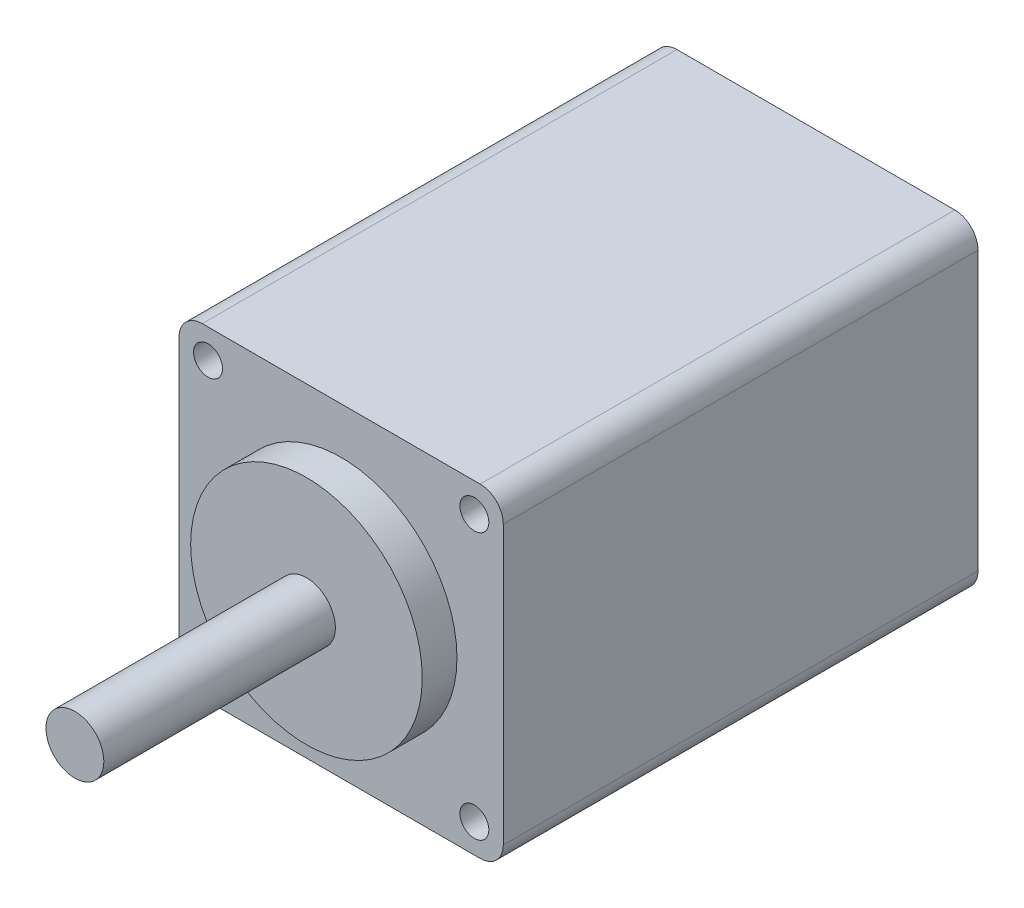
ISO-10303-21;
HEADER;
FILE_DESCRIPTION(('STEP AP214'),'2;1');
FILE_NAME('part.step','',(''),(''),'','','');
FILE_SCHEMA(('AUTOMOTIVE_DESIGN { 1 0 10303 214 1 1 1 1 }'));
ENDSEC;
DATA;
#1=APPLICATION_CONTEXT('core data for automotive mechanical design processes');
#2=APPLICATION_PROTOCOL_DEFINITION('international standard','automotive_design',2000,#1);
#3=PRODUCT_CONTEXT('',#1,'mechanical');
#4=PRODUCT('Part','Part','',(#3));
#5=PRODUCT_RELATED_PRODUCT_CATEGORY('part','',(#4));
#6=PRODUCT_DEFINITION_FORMATION('','',#4);
#7=PRODUCT_DEFINITION_CONTEXT('part definition',#1,'design');
#8=PRODUCT_DEFINITION('design','',#6,#7);
#9=PRODUCT_DEFINITION_SHAPE('','',#8);
#10=(LENGTH_UNIT() NAMED_UNIT(*) SI_UNIT(.MILLI.,.METRE.));
#11=(NAMED_UNIT(*) PLANE_ANGLE_UNIT() SI_UNIT($,.RADIAN.));
#12=(NAMED_UNIT(*) SI_UNIT($,.STERADIAN.) SOLID_ANGLE_UNIT());
#13=UNCERTAINTY_MEASURE_WITH_UNIT(LENGTH_MEASURE(1.E-05),#10,'distance_accuracy_value','');
#14=(GEOMETRIC_REPRESENTATION_CONTEXT(3) GLOBAL_UNCERTAINTY_ASSIGNED_CONTEXT((#13)) GLOBAL_UNIT_ASSIGNED_CONTEXT((#10,
#11,#12)) REPRESENTATION_CONTEXT('',''));
#15=CARTESIAN_POINT('',(0.,0.,0.));
#16=DIRECTION('',(0.,0.,1.));
#17=DIRECTION('',(1.,0.,0.));
#18=AXIS2_PLACEMENT_3D('',#15,#16,#17);
#19=CARTESIAN_POINT('',(0.,0.,41.));
#20=DIRECTION('',(0.,0.,1.));
#21=DIRECTION('',(1.,0.,0.));
#22=AXIS2_PLACEMENT_3D('',#19,#20,#21);
#23=PLANE('',#22);
#24=CARTESIAN_POINT('',(0.,0.,41.));
#25=DIRECTION('',(0.,0.,1.));
#26=DIRECTION('',(1.,0.,0.));
#27=AXIS2_PLACEMENT_3D('',#24,#25,#26);
#28=CIRCLE('',#27,10.);
#29=CARTESIAN_POINT('',(10.,0.,41.));
#30=VERTEX_POINT('',#29);
#31=EDGE_CURVE('E202',#30,#30,#28,.T.);
#32=ORIENTED_EDGE('',*,*,#31,.F.);
#33=EDGE_LOOP('',(#32));
#34=FACE_BOUND('',#33,.T.);
#35=CARTESIAN_POINT('',(11.5,-11.5,41.));
#36=DIRECTION('',(0.,0.,1.));
#37=DIRECTION('',(1.,0.,0.));
#38=AXIS2_PLACEMENT_3D('',#35,#36,#37);
#39=CIRCLE('',#38,1.25);
#40=CARTESIAN_POINT('',(12.75,-11.5,41.));
#41=VERTEX_POINT('',#40);
#42=EDGE_CURVE('E187',#41,#41,#39,.T.);
#43=ORIENTED_EDGE('',*,*,#42,.F.);
#44=EDGE_LOOP('',(#43));
#45=FACE_BOUND('',#44,.T.);
#46=CARTESIAN_POINT('',(-11.5,11.5,41.));
#47=DIRECTION('',(0.,0.,1.));
#48=DIRECTION('',(1.,0.,0.));
#49=AXIS2_PLACEMENT_3D('',#46,#47,#48);
#50=CIRCLE('',#49,1.25);
#51=CARTESIAN_POINT('',(-10.25,11.5,41.));
#52=VERTEX_POINT('',#51);
#53=EDGE_CURVE('E170',#52,#52,#50,.T.);
#54=ORIENTED_EDGE('',*,*,#53,.F.);
#55=EDGE_LOOP('',(#54));
#56=FACE_BOUND('',#55,.T.);
#57=DIRECTION('',(0.,-1.,0.));
#58=VECTOR('',#57,1.);
#59=CARTESIAN_POINT('',(-14.,14.,41.));
#60=LINE('',#59,#58);
#61=CARTESIAN_POINT('',(-14.,12.,41.));
#62=VERTEX_POINT('',#61);
#63=CARTESIAN_POINT('',(-14.,-12.,41.));
#64=VERTEX_POINT('',#63);
#65=EDGE_CURVE('E177',#62,#64,#60,.T.);
#66=ORIENTED_EDGE('',*,*,#65,.T.);
#67=CARTESIAN_POINT('',(-12.,-12.,41.));
#68=DIRECTION('',(0.,0.,1.));
#69=DIRECTION('',(1.,0.,0.));
#70=AXIS2_PLACEMENT_3D('',#67,#68,#69);
#71=CIRCLE('',#70,2.);
#72=CARTESIAN_POINT('',(-12.,-14.,41.));
#73=VERTEX_POINT('',#72);
#74=EDGE_CURVE('E154',#64,#73,#71,.T.);
#75=ORIENTED_EDGE('',*,*,#74,.T.);
#76=DIRECTION('',(1.,0.,0.));
#77=VECTOR('',#76,1.);
#78=CARTESIAN_POINT('',(-14.,-14.,41.));
#79=LINE('',#78,#77);
#80=CARTESIAN_POINT('',(12.,-14.,41.));
#81=VERTEX_POINT('',#80);
#82=EDGE_CURVE('E124',#73,#81,#79,.T.);
#83=ORIENTED_EDGE('',*,*,#82,.T.);
#84=CARTESIAN_POINT('',(12.,-12.,41.));
#85=DIRECTION('',(0.,0.,1.));
#86=DIRECTION('',(1.,0.,0.));
#87=AXIS2_PLACEMENT_3D('',#84,#85,#86);
#88=CIRCLE('',#87,2.);
#89=CARTESIAN_POINT('',(14.,-12.,41.));
#90=VERTEX_POINT('',#89);
#91=EDGE_CURVE('E152',#81,#90,#88,.T.);
#92=ORIENTED_EDGE('',*,*,#91,.T.);
#93=DIRECTION('',(0.,1.,0.));
#94=VECTOR('',#93,1.);
#95=CARTESIAN_POINT('',(14.,14.,41.));
#96=LINE('',#95,#94);
#97=CARTESIAN_POINT('',(14.,12.,41.));
#98=VERTEX_POINT('',#97);
#99=EDGE_CURVE('E131',#90,#98,#96,.T.);
#100=ORIENTED_EDGE('',*,*,#99,.T.);
#101=CARTESIAN_POINT('',(12.,12.,41.));
#102=DIRECTION('',(0.,0.,1.));
#103=DIRECTION('',(1.,0.,0.));
#104=AXIS2_PLACEMENT_3D('',#101,#102,#103);
#105=CIRCLE('',#104,2.);
#106=CARTESIAN_POINT('',(12.,14.,41.));
#107=VERTEX_POINT('',#106);
#108=EDGE_CURVE('E59',#98,#107,#105,.T.);
#109=ORIENTED_EDGE('',*,*,#108,.T.);
#110=DIRECTION('',(-1.,0.,0.));
#111=VECTOR('',#110,1.);
#112=CARTESIAN_POINT('',(-14.,14.,41.));
#113=LINE('',#112,#111);
#114=CARTESIAN_POINT('',(-12.,14.,41.));
#115=VERTEX_POINT('',#114);
#116=EDGE_CURVE('E134',#107,#115,#113,.T.);
#117=ORIENTED_EDGE('',*,*,#116,.T.);
#118=CARTESIAN_POINT('',(-12.,12.,41.));
#119=DIRECTION('',(0.,0.,1.));
#120=DIRECTION('',(1.,0.,0.));
#121=AXIS2_PLACEMENT_3D('',#118,#119,#120);
#122=CIRCLE('',#121,2.);
#123=EDGE_CURVE('E149',#115,#62,#122,.T.);
#124=ORIENTED_EDGE('',*,*,#123,.T.);
#125=EDGE_LOOP('',(#66,#75,#83,#92,#100,#109,#117,#124));
#126=FACE_BOUND('',#125,.T.);
#127=CARTESIAN_POINT('',(11.5,11.5,41.));
#128=DIRECTION('',(0.,0.,1.));
#129=DIRECTION('',(-1.,0.,0.));
#130=AXIS2_PLACEMENT_3D('',#127,#128,#129);
#131=CIRCLE('',#130,1.25);
#132=CARTESIAN_POINT('',(10.25,11.5,41.));
#133=VERTEX_POINT('',#132);
#134=EDGE_CURVE('E182',#133,#133,#131,.T.);
#135=ORIENTED_EDGE('',*,*,#134,.F.);
#136=EDGE_LOOP('',(#135));
#137=FACE_BOUND('',#136,.T.);
#138=CARTESIAN_POINT('',(-11.5,-11.5,41.));
#139=DIRECTION('',(0.,0.,1.));
#140=DIRECTION('',(-1.,0.,0.));
#141=AXIS2_PLACEMENT_3D('',#138,#139,#140);
#142=CIRCLE('',#141,1.25);
#143=CARTESIAN_POINT('',(-12.75,-11.5,41.));
#144=VERTEX_POINT('',#143);
#145=EDGE_CURVE('E193',#144,#144,#142,.T.);
#146=ORIENTED_EDGE('',*,*,#145,.F.);
#147=EDGE_LOOP('',(#146));
#148=FACE_BOUND('',#147,.T.);
#149=ADVANCED_FACE('F38',(#34,#45,#56,#126,#137,#148),#23,.T.);
#150=CARTESIAN_POINT('',(0.,0.,0.));
#151=DIRECTION('',(0.,0.,1.));
#152=DIRECTION('',(1.,0.,0.));
#153=AXIS2_PLACEMENT_3D('',#150,#151,#152);
#154=PLANE('',#153);
#155=DIRECTION('',(1.,0.,0.));
#156=VECTOR('',#155,1.);
#157=CARTESIAN_POINT('',(-14.,-14.,0.));
#158=LINE('',#157,#156);
#159=CARTESIAN_POINT('',(-12.,-14.,0.));
#160=VERTEX_POINT('',#159);
#161=CARTESIAN_POINT('',(12.,-14.,0.));
#162=VERTEX_POINT('',#161);
#163=EDGE_CURVE('E121',#160,#162,#158,.T.);
#164=ORIENTED_EDGE('',*,*,#163,.F.);
#165=CARTESIAN_POINT('',(-12.,-12.,0.));
#166=DIRECTION('',(0.,0.,1.));
#167=DIRECTION('',(1.,0.,0.));
#168=AXIS2_PLACEMENT_3D('',#165,#166,#167);
#169=CIRCLE('',#168,2.);
#170=CARTESIAN_POINT('',(-14.,-12.,0.));
#171=VERTEX_POINT('',#170);
#172=EDGE_CURVE('E104',#160,#171,#169,.F.);
#173=ORIENTED_EDGE('',*,*,#172,.T.);
#174=DIRECTION('',(0.,-1.,0.));
#175=VECTOR('',#174,1.);
#176=CARTESIAN_POINT('',(-14.,14.,0.));
#177=LINE('',#176,#175);
#178=CARTESIAN_POINT('',(-14.,12.,0.));
#179=VERTEX_POINT('',#178);
#180=EDGE_CURVE('E132',#179,#171,#177,.T.);
#181=ORIENTED_EDGE('',*,*,#180,.F.);
#182=CARTESIAN_POINT('',(-12.,12.,0.));
#183=DIRECTION('',(0.,0.,1.));
#184=DIRECTION('',(1.,0.,0.));
#185=AXIS2_PLACEMENT_3D('',#182,#183,#184);
#186=CIRCLE('',#185,2.);
#187=CARTESIAN_POINT('',(-12.,14.,0.));
#188=VERTEX_POINT('',#187);
#189=EDGE_CURVE('E125',#179,#188,#186,.F.);
#190=ORIENTED_EDGE('',*,*,#189,.T.);
#191=DIRECTION('',(-1.,0.,0.));
#192=VECTOR('',#191,1.);
#193=CARTESIAN_POINT('',(-14.,14.,0.));
#194=LINE('',#193,#192);
#195=CARTESIAN_POINT('',(12.,14.,0.));
#196=VERTEX_POINT('',#195);
#197=EDGE_CURVE('E136',#196,#188,#194,.T.);
#198=ORIENTED_EDGE('',*,*,#197,.F.);
#199=CARTESIAN_POINT('',(12.,12.,0.));
#200=DIRECTION('',(0.,0.,1.));
#201=DIRECTION('',(1.,0.,0.));
#202=AXIS2_PLACEMENT_3D('',#199,#200,#201);
#203=CIRCLE('',#202,2.);
#204=CARTESIAN_POINT('',(14.,12.,0.));
#205=VERTEX_POINT('',#204);
#206=EDGE_CURVE('E143',#196,#205,#203,.F.);
#207=ORIENTED_EDGE('',*,*,#206,.T.);
#208=DIRECTION('',(0.,1.,0.));
#209=VECTOR('',#208,1.);
#210=CARTESIAN_POINT('',(14.,14.,0.));
#211=LINE('',#210,#209);
#212=CARTESIAN_POINT('',(14.,-12.,0.));
#213=VERTEX_POINT('',#212);
#214=EDGE_CURVE('E165',#213,#205,#211,.T.);
#215=ORIENTED_EDGE('',*,*,#214,.F.);
#216=CARTESIAN_POINT('',(12.,-12.,0.));
#217=DIRECTION('',(0.,0.,1.));
#218=DIRECTION('',(1.,0.,0.));
#219=AXIS2_PLACEMENT_3D('',#216,#217,#218);
#220=CIRCLE('',#219,2.);
#221=EDGE_CURVE('E115',#213,#162,#220,.F.);
#222=ORIENTED_EDGE('',*,*,#221,.T.);
#223=EDGE_LOOP('',(#164,#173,#181,#190,#198,#207,#215,#222));
#224=FACE_BOUND('',#223,.T.);
#225=CARTESIAN_POINT('',(-11.5,11.5,0.));
#226=DIRECTION('',(0.,0.,1.));
#227=DIRECTION('',(1.,0.,0.));
#228=AXIS2_PLACEMENT_3D('',#225,#226,#227);
#229=CIRCLE('',#228,1.25);
#230=CARTESIAN_POINT('',(-10.25,11.5,0.));
#231=VERTEX_POINT('',#230);
#232=EDGE_CURVE('E173',#231,#231,#229,.T.);
#233=ORIENTED_EDGE('',*,*,#232,.T.);
#234=EDGE_LOOP('',(#233));
#235=FACE_BOUND('',#234,.T.);
#236=CARTESIAN_POINT('',(11.5,11.5,0.));
#237=DIRECTION('',(0.,0.,1.));
#238=DIRECTION('',(-1.,0.,0.));
#239=AXIS2_PLACEMENT_3D('',#236,#237,#238);
#240=CIRCLE('',#239,1.25);
#241=CARTESIAN_POINT('',(10.25,11.5,0.));
#242=VERTEX_POINT('',#241);
#243=EDGE_CURVE('E184',#242,#242,#240,.T.);
#244=ORIENTED_EDGE('',*,*,#243,.T.);
#245=EDGE_LOOP('',(#244));
#246=FACE_BOUND('',#245,.T.);
#247=CARTESIAN_POINT('',(11.5,-11.5,0.));
#248=DIRECTION('',(0.,0.,1.));
#249=DIRECTION('',(1.,0.,0.));
#250=AXIS2_PLACEMENT_3D('',#247,#248,#249);
#251=CIRCLE('',#250,1.25);
#252=CARTESIAN_POINT('',(12.75,-11.5,0.));
#253=VERTEX_POINT('',#252);
#254=EDGE_CURVE('E190',#253,#253,#251,.T.);
#255=ORIENTED_EDGE('',*,*,#254,.T.);
#256=EDGE_LOOP('',(#255));
#257=FACE_BOUND('',#256,.T.);
#258=CARTESIAN_POINT('',(-11.5,-11.5,0.));
#259=DIRECTION('',(0.,0.,1.));
#260=DIRECTION('',(-1.,0.,0.));
#261=AXIS2_PLACEMENT_3D('',#258,#259,#260);
#262=CIRCLE('',#261,1.25);
#263=CARTESIAN_POINT('',(-12.75,-11.5,0.));
#264=VERTEX_POINT('',#263);
#265=EDGE_CURVE('E196',#264,#264,#262,.T.);
#266=ORIENTED_EDGE('',*,*,#265,.T.);
#267=EDGE_LOOP('',(#266));
#268=FACE_BOUND('',#267,.T.);
#269=ADVANCED_FACE('F128',(#224,#235,#246,#257,#268),#154,.F.);
#270=CARTESIAN_POINT('',(14.,14.,41.));
#271=DIRECTION('',(-1.,0.,0.));
#272=DIRECTION('',(0.,0.,1.));
#273=AXIS2_PLACEMENT_3D('',#270,#271,#272);
#274=PLANE('',#273);
#275=ORIENTED_EDGE('',*,*,#99,.F.);
#276=DIRECTION('',(0.,0.,-1.));
#277=VECTOR('',#276,1.);
#278=CARTESIAN_POINT('',(14.,-12.,41.));
#279=LINE('',#278,#277);
#280=EDGE_CURVE('E158',#90,#213,#279,.T.);
#281=ORIENTED_EDGE('',*,*,#280,.T.);
#282=ORIENTED_EDGE('',*,*,#214,.T.);
#283=DIRECTION('',(0.,0.,-1.));
#284=VECTOR('',#283,1.);
#285=CARTESIAN_POINT('',(14.,12.,41.));
#286=LINE('',#285,#284);
#287=EDGE_CURVE('E156',#205,#98,#286,.F.);
#288=ORIENTED_EDGE('',*,*,#287,.T.);
#289=EDGE_LOOP('',(#275,#281,#282,#288));
#290=FACE_BOUND('',#289,.T.);
#291=ADVANCED_FACE('F164',(#290),#274,.F.);
#292=CARTESIAN_POINT('',(-14.,14.,41.));
#293=DIRECTION('',(0.,-1.,0.));
#294=DIRECTION('',(0.,0.,-1.));
#295=AXIS2_PLACEMENT_3D('',#292,#293,#294);
#296=PLANE('',#295);
#297=ORIENTED_EDGE('',*,*,#116,.F.);
#298=DIRECTION('',(0.,0.,-1.));
#299=VECTOR('',#298,1.);
#300=CARTESIAN_POINT('',(12.,14.,41.));
#301=LINE('',#300,#299);
#302=EDGE_CURVE('E11',#107,#196,#301,.T.);
#303=ORIENTED_EDGE('',*,*,#302,.T.);
#304=ORIENTED_EDGE('',*,*,#197,.T.);
#305=DIRECTION('',(0.,0.,-1.));
#306=VECTOR('',#305,1.);
#307=CARTESIAN_POINT('',(-12.,14.,41.));
#308=LINE('',#307,#306);
#309=EDGE_CURVE('E46',#188,#115,#308,.F.);
#310=ORIENTED_EDGE('',*,*,#309,.T.);
#311=EDGE_LOOP('',(#297,#303,#304,#310));
#312=FACE_BOUND('',#311,.T.);
#313=ADVANCED_FACE('F257',(#312),#296,.F.);
#314=CARTESIAN_POINT('',(-14.,14.,41.));
#315=DIRECTION('',(1.,0.,0.));
#316=DIRECTION('',(0.,0.,-1.));
#317=AXIS2_PLACEMENT_3D('',#314,#315,#316);
#318=PLANE('',#317);
#319=ORIENTED_EDGE('',*,*,#180,.T.);
#320=DIRECTION('',(0.,0.,-1.));
#321=VECTOR('',#320,1.);
#322=CARTESIAN_POINT('',(-14.,-12.,41.));
#323=LINE('',#322,#321);
#324=EDGE_CURVE('E109',#171,#64,#323,.F.);
#325=ORIENTED_EDGE('',*,*,#324,.T.);
#326=ORIENTED_EDGE('',*,*,#65,.F.);
#327=DIRECTION('',(0.,0.,-1.));
#328=VECTOR('',#327,1.);
#329=CARTESIAN_POINT('',(-14.,12.,41.));
#330=LINE('',#329,#328);
#331=EDGE_CURVE('E114',#62,#179,#330,.T.);
#332=ORIENTED_EDGE('',*,*,#331,.T.);
#333=EDGE_LOOP('',(#319,#325,#326,#332));
#334=FACE_BOUND('',#333,.T.);
#335=ADVANCED_FACE('F264',(#334),#318,.F.);
#336=CARTESIAN_POINT('',(-14.,-14.,41.));
#337=DIRECTION('',(0.,1.,0.));
#338=DIRECTION('',(0.,0.,1.));
#339=AXIS2_PLACEMENT_3D('',#336,#337,#338);
#340=PLANE('',#339);
#341=ORIENTED_EDGE('',*,*,#82,.F.);
#342=DIRECTION('',(0.,0.,-1.));
#343=VECTOR('',#342,1.);
#344=CARTESIAN_POINT('',(-12.,-14.,41.));
#345=LINE('',#344,#343);
#346=EDGE_CURVE('E108',#73,#160,#345,.T.);
#347=ORIENTED_EDGE('',*,*,#346,.T.);
#348=ORIENTED_EDGE('',*,*,#163,.T.);
#349=DIRECTION('',(0.,0.,-1.));
#350=VECTOR('',#349,1.);
#351=CARTESIAN_POINT('',(12.,-14.,41.));
#352=LINE('',#351,#350);
#353=EDGE_CURVE('E126',#162,#81,#352,.F.);
#354=ORIENTED_EDGE('',*,*,#353,.T.);
#355=EDGE_LOOP('',(#341,#347,#348,#354));
#356=FACE_BOUND('',#355,.T.);
#357=ADVANCED_FACE('F120',(#356),#340,.F.);
#358=CARTESIAN_POINT('',(-11.5,11.5,41.));
#359=DIRECTION('',(0.,0.,-1.));
#360=DIRECTION('',(-1.,0.,0.));
#361=AXIS2_PLACEMENT_3D('',#358,#359,#360);
#362=CYLINDRICAL_SURFACE('',#361,1.25);
#363=ORIENTED_EDGE('',*,*,#53,.T.);
#364=EDGE_LOOP('',(#363));
#365=FACE_BOUND('',#364,.T.);
#366=ORIENTED_EDGE('',*,*,#232,.F.);
#367=EDGE_LOOP('',(#366));
#368=FACE_BOUND('',#367,.T.);
#369=ADVANCED_FACE('F263',(#365,#368),#362,.F.);
#370=CARTESIAN_POINT('',(11.5,11.5,41.));
#371=DIRECTION('',(0.,0.,-1.));
#372=DIRECTION('',(-1.,0.,0.));
#373=AXIS2_PLACEMENT_3D('',#370,#371,#372);
#374=CYLINDRICAL_SURFACE('',#373,1.25);
#375=ORIENTED_EDGE('',*,*,#134,.T.);
#376=EDGE_LOOP('',(#375));
#377=FACE_BOUND('',#376,.T.);
#378=ORIENTED_EDGE('',*,*,#243,.F.);
#379=EDGE_LOOP('',(#378));
#380=FACE_BOUND('',#379,.T.);
#381=ADVANCED_FACE('F394',(#377,#380),#374,.F.);
#382=CARTESIAN_POINT('',(11.5,-11.5,41.));
#383=DIRECTION('',(0.,0.,-1.));
#384=DIRECTION('',(-1.,0.,0.));
#385=AXIS2_PLACEMENT_3D('',#382,#383,#384);
#386=CYLINDRICAL_SURFACE('',#385,1.25);
#387=ORIENTED_EDGE('',*,*,#42,.T.);
#388=EDGE_LOOP('',(#387));
#389=FACE_BOUND('',#388,.T.);
#390=ORIENTED_EDGE('',*,*,#254,.F.);
#391=EDGE_LOOP('',(#390));
#392=FACE_BOUND('',#391,.T.);
#393=ADVANCED_FACE('F248',(#389,#392),#386,.F.);
#394=CARTESIAN_POINT('',(-11.5,-11.5,41.));
#395=DIRECTION('',(0.,0.,-1.));
#396=DIRECTION('',(-1.,0.,0.));
#397=AXIS2_PLACEMENT_3D('',#394,#395,#396);
#398=CYLINDRICAL_SURFACE('',#397,1.25);
#399=ORIENTED_EDGE('',*,*,#145,.T.);
#400=EDGE_LOOP('',(#399));
#401=FACE_BOUND('',#400,.T.);
#402=ORIENTED_EDGE('',*,*,#265,.F.);
#403=EDGE_LOOP('',(#402));
#404=FACE_BOUND('',#403,.T.);
#405=ADVANCED_FACE('F230',(#401,#404),#398,.F.);
#406=CARTESIAN_POINT('',(0.,0.,44.));
#407=DIRECTION('',(0.,0.,-1.));
#408=DIRECTION('',(-1.,0.,0.));
#409=AXIS2_PLACEMENT_3D('',#406,#407,#408);
#410=CYLINDRICAL_SURFACE('',#409,10.);
#411=CARTESIAN_POINT('',(0.,0.,44.));
#412=DIRECTION('',(0.,0.,1.));
#413=DIRECTION('',(1.,0.,0.));
#414=AXIS2_PLACEMENT_3D('',#411,#412,#413);
#415=CIRCLE('',#414,10.);
#416=CARTESIAN_POINT('',(10.,0.,44.));
#417=VERTEX_POINT('',#416);
#418=EDGE_CURVE('E199',#417,#417,#415,.T.);
#419=ORIENTED_EDGE('',*,*,#418,.F.);
#420=EDGE_LOOP('',(#419));
#421=FACE_BOUND('',#420,.T.);
#422=ORIENTED_EDGE('',*,*,#31,.T.);
#423=EDGE_LOOP('',(#422));
#424=FACE_BOUND('',#423,.T.);
#425=ADVANCED_FACE('F224',(#421,#424),#410,.T.);
#426=CARTESIAN_POINT('',(0.,0.,44.));
#427=DIRECTION('',(0.,0.,1.));
#428=DIRECTION('',(1.,0.,0.));
#429=AXIS2_PLACEMENT_3D('',#426,#427,#428);
#430=PLANE('',#429);
#431=CARTESIAN_POINT('',(0.,0.,44.));
#432=DIRECTION('',(0.,0.,1.));
#433=DIRECTION('',(1.,0.,0.));
#434=AXIS2_PLACEMENT_3D('',#431,#432,#433);
#435=CIRCLE('',#434,2.5);
#436=CARTESIAN_POINT('',(2.5,0.,44.));
#437=VERTEX_POINT('',#436);
#438=EDGE_CURVE('E140',#437,#437,#435,.T.);
#439=ORIENTED_EDGE('',*,*,#438,.F.);
#440=EDGE_LOOP('',(#439));
#441=FACE_BOUND('',#440,.T.);
#442=ORIENTED_EDGE('',*,*,#418,.T.);
#443=EDGE_LOOP('',(#442));
#444=FACE_BOUND('',#443,.T.);
#445=ADVANCED_FACE('F218',(#441,#444),#430,.T.);
#446=CARTESIAN_POINT('',(0.,0.,64.));
#447=DIRECTION('',(0.,0.,-1.));
#448=DIRECTION('',(-1.,0.,0.));
#449=AXIS2_PLACEMENT_3D('',#446,#447,#448);
#450=CYLINDRICAL_SURFACE('',#449,2.5);
#451=CARTESIAN_POINT('',(0.,0.,64.));
#452=DIRECTION('',(0.,0.,1.));
#453=DIRECTION('',(1.,0.,0.));
#454=AXIS2_PLACEMENT_3D('',#451,#452,#453);
#455=CIRCLE('',#454,2.5);
#456=CARTESIAN_POINT('',(2.5,0.,64.));
#457=VERTEX_POINT('',#456);
#458=EDGE_CURVE('E205',#457,#457,#455,.T.);
#459=ORIENTED_EDGE('',*,*,#458,.F.);
#460=EDGE_LOOP('',(#459));
#461=FACE_BOUND('',#460,.T.);
#462=ORIENTED_EDGE('',*,*,#438,.T.);
#463=EDGE_LOOP('',(#462));
#464=FACE_BOUND('',#463,.T.);
#465=ADVANCED_FACE('F215',(#461,#464),#450,.T.);
#466=CARTESIAN_POINT('',(0.,0.,64.));
#467=DIRECTION('',(0.,0.,1.));
#468=DIRECTION('',(1.,0.,0.));
#469=AXIS2_PLACEMENT_3D('',#466,#467,#468);
#470=PLANE('',#469);
#471=ORIENTED_EDGE('',*,*,#458,.T.);
#472=EDGE_LOOP('',(#471));
#473=FACE_BOUND('',#472,.T.);
#474=ADVANCED_FACE('F213',(#473),#470,.T.);
#475=CARTESIAN_POINT('',(-12.,-12.,41.));
#476=DIRECTION('',(0.,0.,-1.));
#477=DIRECTION('',(-1.,0.,0.));
#478=AXIS2_PLACEMENT_3D('',#475,#476,#477);
#479=CYLINDRICAL_SURFACE('',#478,2.);
#480=ORIENTED_EDGE('',*,*,#74,.F.);
#481=ORIENTED_EDGE('',*,*,#324,.F.);
#482=ORIENTED_EDGE('',*,*,#172,.F.);
#483=ORIENTED_EDGE('',*,*,#346,.F.);
#484=EDGE_LOOP('',(#480,#481,#482,#483));
#485=FACE_BOUND('',#484,.T.);
#486=ADVANCED_FACE('F107',(#485),#479,.T.);
#487=CARTESIAN_POINT('',(12.,-12.,41.));
#488=DIRECTION('',(0.,0.,-1.));
#489=DIRECTION('',(-1.,0.,0.));
#490=AXIS2_PLACEMENT_3D('',#487,#488,#489);
#491=CYLINDRICAL_SURFACE('',#490,2.);
#492=ORIENTED_EDGE('',*,*,#91,.F.);
#493=ORIENTED_EDGE('',*,*,#353,.F.);
#494=ORIENTED_EDGE('',*,*,#221,.F.);
#495=ORIENTED_EDGE('',*,*,#280,.F.);
#496=EDGE_LOOP('',(#492,#493,#494,#495));
#497=FACE_BOUND('',#496,.T.);
#498=ADVANCED_FACE('F272',(#497),#491,.T.);
#499=CARTESIAN_POINT('',(12.,12.,41.));
#500=DIRECTION('',(0.,0.,-1.));
#501=DIRECTION('',(-1.,0.,0.));
#502=AXIS2_PLACEMENT_3D('',#499,#500,#501);
#503=CYLINDRICAL_SURFACE('',#502,2.);
#504=ORIENTED_EDGE('',*,*,#108,.F.);
#505=ORIENTED_EDGE('',*,*,#287,.F.);
#506=ORIENTED_EDGE('',*,*,#206,.F.);
#507=ORIENTED_EDGE('',*,*,#302,.F.);
#508=EDGE_LOOP('',(#504,#505,#506,#507));
#509=FACE_BOUND('',#508,.T.);
#510=ADVANCED_FACE('F274',(#509),#503,.T.);
#511=CARTESIAN_POINT('',(-12.,12.,41.));
#512=DIRECTION('',(0.,0.,-1.));
#513=DIRECTION('',(-1.,0.,0.));
#514=AXIS2_PLACEMENT_3D('',#511,#512,#513);
#515=CYLINDRICAL_SURFACE('',#514,2.);
#516=ORIENTED_EDGE('',*,*,#123,.F.);
#517=ORIENTED_EDGE('',*,*,#309,.F.);
#518=ORIENTED_EDGE('',*,*,#189,.F.);
#519=ORIENTED_EDGE('',*,*,#331,.F.);
#520=EDGE_LOOP('',(#516,#517,#518,#519));
#521=FACE_BOUND('',#520,.T.);
#522=ADVANCED_FACE('F40',(#521),#515,.T.);
#523=CLOSED_SHELL('',(#149,#269,#291,#313,#335,#357,#369,#381,#393,#405,#425,#445,#465,#474,
#486,#498,#510,#522));
#524=MANIFOLD_SOLID_BREP('B2',#523);
#525=ADVANCED_BREP_SHAPE_REPRESENTATION('',(#18,#524),#14);
#526=SHAPE_DEFINITION_REPRESENTATION(#9,#525);
ENDSEC;
END-ISO-10303-21;
